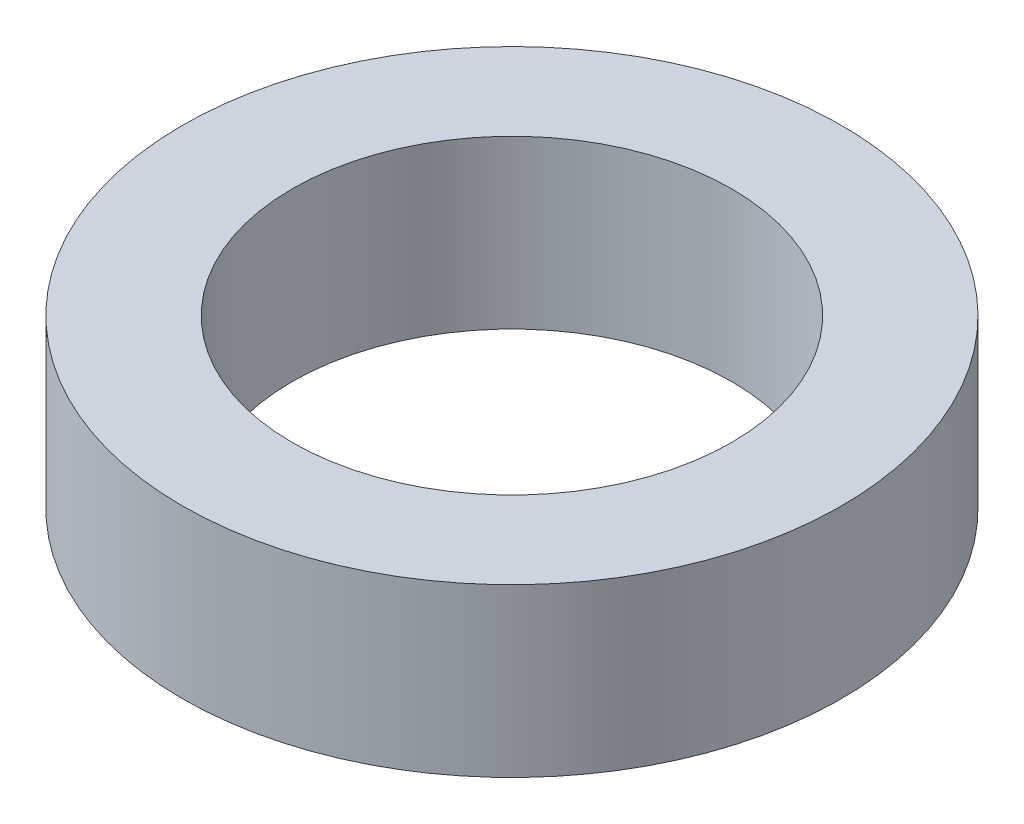
ISO-10303-21;
HEADER;
FILE_DESCRIPTION(('STEP AP214'),'2;1');
FILE_NAME('part.step','',(''),(''),'','','');
FILE_SCHEMA(('AUTOMOTIVE_DESIGN { 1 0 10303 214 1 1 1 1 }'));
ENDSEC;
DATA;
#1=APPLICATION_CONTEXT('core data for automotive mechanical design processes');
#2=APPLICATION_PROTOCOL_DEFINITION('international standard','automotive_design',2000,#1);
#3=PRODUCT_CONTEXT('',#1,'mechanical');
#4=PRODUCT('Part','Part','',(#3));
#5=PRODUCT_RELATED_PRODUCT_CATEGORY('part','',(#4));
#6=PRODUCT_DEFINITION_FORMATION('','',#4);
#7=PRODUCT_DEFINITION_CONTEXT('part definition',#1,'design');
#8=PRODUCT_DEFINITION('design','',#6,#7);
#9=PRODUCT_DEFINITION_SHAPE('','',#8);
#10=(LENGTH_UNIT() NAMED_UNIT(*) SI_UNIT(.MILLI.,.METRE.));
#11=(NAMED_UNIT(*) PLANE_ANGLE_UNIT() SI_UNIT($,.RADIAN.));
#12=(NAMED_UNIT(*) SI_UNIT($,.STERADIAN.) SOLID_ANGLE_UNIT());
#13=UNCERTAINTY_MEASURE_WITH_UNIT(LENGTH_MEASURE(1.E-05),#10,'distance_accuracy_value','');
#14=(GEOMETRIC_REPRESENTATION_CONTEXT(3) GLOBAL_UNCERTAINTY_ASSIGNED_CONTEXT((#13)) GLOBAL_UNIT_ASSIGNED_CONTEXT((#10,
#11,#12)) REPRESENTATION_CONTEXT('',''));
#15=CARTESIAN_POINT('',(0.,0.,0.));
#16=DIRECTION('',(0.,0.,1.));
#17=DIRECTION('',(1.,0.,0.));
#18=AXIS2_PLACEMENT_3D('',#15,#16,#17);
#19=CARTESIAN_POINT('',(0.,19.,0.));
#20=DIRECTION('',(0.,-1.,0.));
#21=DIRECTION('',(0.,0.,-1.));
#22=AXIS2_PLACEMENT_3D('',#19,#20,#21);
#23=CYLINDRICAL_SURFACE('',#22,37.5);
#24=CARTESIAN_POINT('',(0.,19.,0.));
#25=DIRECTION('',(0.,1.,0.));
#26=DIRECTION('',(0.,0.,1.));
#27=AXIS2_PLACEMENT_3D('',#24,#25,#26);
#28=CIRCLE('',#27,37.5);
#29=CARTESIAN_POINT('',(0.,19.,37.5));
#30=VERTEX_POINT('',#29);
#31=EDGE_CURVE('E10',#30,#30,#28,.T.);
#32=ORIENTED_EDGE('',*,*,#31,.F.);
#33=EDGE_LOOP('',(#32));
#34=FACE_BOUND('',#33,.T.);
#35=CARTESIAN_POINT('',(0.,0.,0.));
#36=DIRECTION('',(0.,1.,0.));
#37=DIRECTION('',(0.,0.,1.));
#38=AXIS2_PLACEMENT_3D('',#35,#36,#37);
#39=CIRCLE('',#38,37.5);
#40=CARTESIAN_POINT('',(0.,0.,37.5));
#41=VERTEX_POINT('',#40);
#42=EDGE_CURVE('E37',#41,#41,#39,.T.);
#43=ORIENTED_EDGE('',*,*,#42,.T.);
#44=EDGE_LOOP('',(#43));
#45=FACE_BOUND('',#44,.T.);
#46=ADVANCED_FACE('F40',(#34,#45),#23,.T.);
#47=CARTESIAN_POINT('',(0.,19.,0.));
#48=DIRECTION('',(0.,1.,0.));
#49=DIRECTION('',(0.,0.,1.));
#50=AXIS2_PLACEMENT_3D('',#47,#48,#49);
#51=PLANE('',#50);
#52=CARTESIAN_POINT('',(0.,19.,0.));
#53=DIRECTION('',(0.,1.,0.));
#54=DIRECTION('',(0.,0.,1.));
#55=AXIS2_PLACEMENT_3D('',#52,#53,#54);
#56=CIRCLE('',#55,25.);
#57=CARTESIAN_POINT('',(0.,19.,25.));
#58=VERTEX_POINT('',#57);
#59=EDGE_CURVE('E50',#58,#58,#56,.T.);
#60=ORIENTED_EDGE('',*,*,#59,.F.);
#61=EDGE_LOOP('',(#60));
#62=FACE_BOUND('',#61,.T.);
#63=ORIENTED_EDGE('',*,*,#31,.T.);
#64=EDGE_LOOP('',(#63));
#65=FACE_BOUND('',#64,.T.);
#66=ADVANCED_FACE('F59',(#62,#65),#51,.T.);
#67=CARTESIAN_POINT('',(0.,0.,0.));
#68=DIRECTION('',(0.,1.,0.));
#69=DIRECTION('',(0.,0.,1.));
#70=AXIS2_PLACEMENT_3D('',#67,#68,#69);
#71=PLANE('',#70);
#72=CARTESIAN_POINT('',(0.,0.,0.));
#73=DIRECTION('',(0.,1.,0.));
#74=DIRECTION('',(0.,0.,1.));
#75=AXIS2_PLACEMENT_3D('',#72,#73,#74);
#76=CIRCLE('',#75,25.);
#77=CARTESIAN_POINT('',(0.,0.,25.));
#78=VERTEX_POINT('',#77);
#79=EDGE_CURVE('E47',#78,#78,#76,.T.);
#80=ORIENTED_EDGE('',*,*,#79,.T.);
#81=EDGE_LOOP('',(#80));
#82=FACE_BOUND('',#81,.T.);
#83=ORIENTED_EDGE('',*,*,#42,.F.);
#84=EDGE_LOOP('',(#83));
#85=FACE_BOUND('',#84,.T.);
#86=ADVANCED_FACE('F58',(#82,#85),#71,.F.);
#87=CARTESIAN_POINT('',(0.,19.,0.));
#88=DIRECTION('',(0.,-1.,0.));
#89=DIRECTION('',(0.,0.,-1.));
#90=AXIS2_PLACEMENT_3D('',#87,#88,#89);
#91=CYLINDRICAL_SURFACE('',#90,25.);
#92=ORIENTED_EDGE('',*,*,#59,.T.);
#93=EDGE_LOOP('',(#92));
#94=FACE_BOUND('',#93,.T.);
#95=ORIENTED_EDGE('',*,*,#79,.F.);
#96=EDGE_LOOP('',(#95));
#97=FACE_BOUND('',#96,.T.);
#98=ADVANCED_FACE('F54',(#94,#97),#91,.F.);
#99=CLOSED_SHELL('',(#46,#66,#86,#98));
#100=MANIFOLD_SOLID_BREP('B2',#99);
#101=ADVANCED_BREP_SHAPE_REPRESENTATION('',(#18,#100),#14);
#102=SHAPE_DEFINITION_REPRESENTATION(#9,#101);
ENDSEC;
END-ISO-10303-21;
